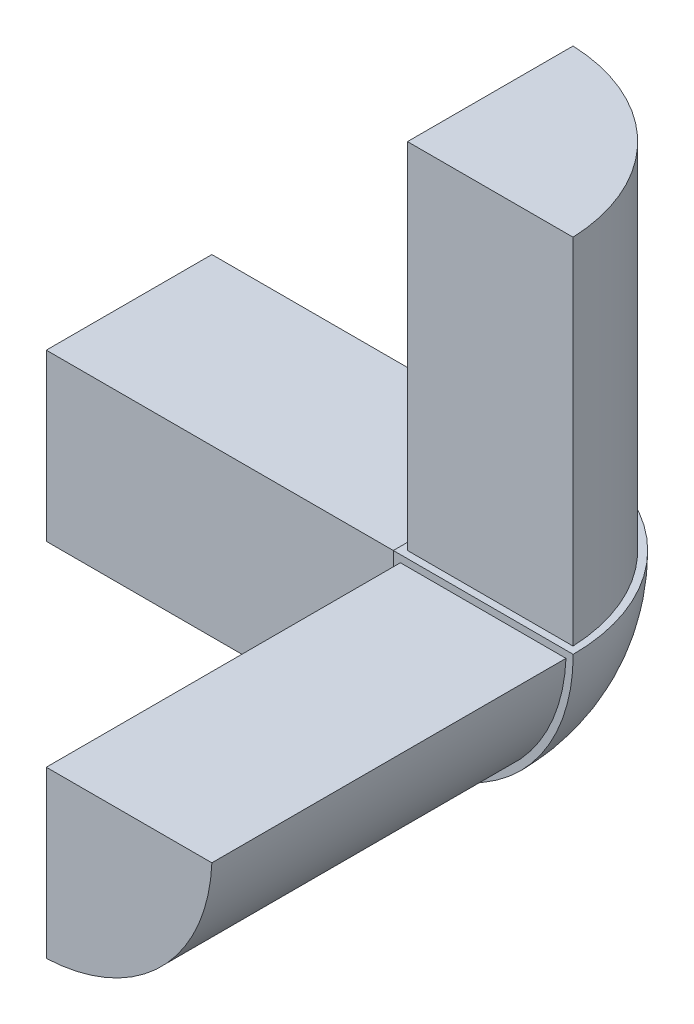
ISO-10303-21;
HEADER;
FILE_DESCRIPTION(('STEP AP214'),'2;1');
FILE_NAME('part.step','',(''),(''),'','','');
FILE_SCHEMA(('AUTOMOTIVE_DESIGN { 1 0 10303 214 1 1 1 1 }'));
ENDSEC;
DATA;
#1=APPLICATION_CONTEXT('core data for automotive mechanical design processes');
#2=APPLICATION_PROTOCOL_DEFINITION('international standard','automotive_design',2000,#1);
#3=PRODUCT_CONTEXT('',#1,'mechanical');
#4=PRODUCT('Part','Part','',(#3));
#5=PRODUCT_RELATED_PRODUCT_CATEGORY('part','',(#4));
#6=PRODUCT_DEFINITION_FORMATION('','',#4);
#7=PRODUCT_DEFINITION_CONTEXT('part definition',#1,'design');
#8=PRODUCT_DEFINITION('design','',#6,#7);
#9=PRODUCT_DEFINITION_SHAPE('','',#8);
#10=(LENGTH_UNIT() NAMED_UNIT(*) SI_UNIT(.MILLI.,.METRE.));
#11=(NAMED_UNIT(*) PLANE_ANGLE_UNIT() SI_UNIT($,.RADIAN.));
#12=(NAMED_UNIT(*) SI_UNIT($,.STERADIAN.) SOLID_ANGLE_UNIT());
#13=UNCERTAINTY_MEASURE_WITH_UNIT(LENGTH_MEASURE(1.E-05),#10,'distance_accuracy_value','');
#14=(GEOMETRIC_REPRESENTATION_CONTEXT(3) GLOBAL_UNCERTAINTY_ASSIGNED_CONTEXT((#13)) GLOBAL_UNIT_ASSIGNED_CONTEXT((#10,
#11,#12)) REPRESENTATION_CONTEXT('',''));
#15=CARTESIAN_POINT('',(0.,0.,0.));
#16=DIRECTION('',(0.,0.,1.));
#17=DIRECTION('',(1.,0.,0.));
#18=AXIS2_PLACEMENT_3D('',#15,#16,#17);
#19=CARTESIAN_POINT('',(0.,0.,50.));
#20=DIRECTION('',(1.,0.,0.));
#21=DIRECTION('',(0.,1.,0.));
#22=AXIS2_PLACEMENT_3D('',#19,#20,#21);
#23=PLANE('',#22);
#24=DIRECTION('',(0.,0.,-1.));
#25=VECTOR('',#24,1.);
#26=CARTESIAN_POINT('',(0.,-1.,-1.));
#27=LINE('',#26,#25);
#28=CARTESIAN_POINT('',(0.,-1.,-1.));
#29=VERTEX_POINT('',#28);
#30=CARTESIAN_POINT('',(0.,-1.,-24.3794995846921));
#31=VERTEX_POINT('',#30);
#32=EDGE_CURVE('E184',#29,#31,#27,.T.);
#33=ORIENTED_EDGE('',*,*,#32,.F.);
#34=DIRECTION('',(0.,1.,0.));
#35=VECTOR('',#34,1.);
#36=CARTESIAN_POINT('',(0.,-24.3794995846921,-1.));
#37=LINE('',#36,#35);
#38=CARTESIAN_POINT('',(0.,-24.3794995846921,-1.));
#39=VERTEX_POINT('',#38);
#40=EDGE_CURVE('E180',#39,#29,#37,.T.);
#41=ORIENTED_EDGE('',*,*,#40,.F.);
#42=CARTESIAN_POINT('',(0.,0.,0.));
#43=DIRECTION('',(-1.,0.,0.));
#44=DIRECTION('',(0.,0.,1.));
#45=AXIS2_PLACEMENT_3D('',#42,#43,#44);
#46=CIRCLE('',#45,24.4);
#47=EDGE_CURVE('E177',#31,#39,#46,.T.);
#48=ORIENTED_EDGE('',*,*,#47,.F.);
#49=EDGE_LOOP('',(#33,#41,#48));
#50=FACE_BOUND('',#49,.T.);
#51=DIRECTION('',(0.,-1.,0.));
#52=VECTOR('',#51,1.);
#53=CARTESIAN_POINT('',(0.,0.,0.));
#54=LINE('',#53,#52);
#55=CARTESIAN_POINT('',(0.,0.,0.));
#56=VERTEX_POINT('',#55);
#57=CARTESIAN_POINT('',(0.,-25.4,0.));
#58=VERTEX_POINT('',#57);
#59=EDGE_CURVE('E152',#56,#58,#54,.T.);
#60=ORIENTED_EDGE('',*,*,#59,.F.);
#61=DIRECTION('',(0.,0.,-1.));
#62=VECTOR('',#61,1.);
#63=CARTESIAN_POINT('',(0.,0.,50.));
#64=LINE('',#63,#62);
#65=CARTESIAN_POINT('',(0.,0.,-25.4));
#66=VERTEX_POINT('',#65);
#67=EDGE_CURVE('E42',#56,#66,#64,.T.);
#68=ORIENTED_EDGE('',*,*,#67,.T.);
#69=CARTESIAN_POINT('',(0.,0.,0.));
#70=DIRECTION('',(1.,0.,0.));
#71=DIRECTION('',(0.,0.,-1.));
#72=AXIS2_PLACEMENT_3D('',#69,#70,#71);
#73=CIRCLE('',#72,25.4);
#74=EDGE_CURVE('E197',#58,#66,#73,.T.);
#75=ORIENTED_EDGE('',*,*,#74,.F.);
#76=EDGE_LOOP('',(#60,#68,#75));
#77=FACE_BOUND('',#76,.T.);
#78=ADVANCED_FACE('F34',(#50,#77),#23,.F.);
#79=CARTESIAN_POINT('',(0.,0.,50.));
#80=DIRECTION('',(0.,-1.,0.));
#81=DIRECTION('',(0.,0.,-1.));
#82=AXIS2_PLACEMENT_3D('',#79,#80,#81);
#83=PLANE('',#82);
#84=DIRECTION('',(1.,0.,0.));
#85=VECTOR('',#84,1.);
#86=CARTESIAN_POINT('',(1.00000000000001,0.,-0.999999999999962));
#87=LINE('',#86,#85);
#88=CARTESIAN_POINT('',(1.00000000000001,0.,-0.999999999999962));
#89=VERTEX_POINT('',#88);
#90=CARTESIAN_POINT('',(24.3794995846921,0.,-0.999999999999962));
#91=VERTEX_POINT('',#90);
#92=EDGE_CURVE('E161',#89,#91,#87,.T.);
#93=ORIENTED_EDGE('',*,*,#92,.F.);
#94=DIRECTION('',(0.,0.,1.));
#95=VECTOR('',#94,1.);
#96=CARTESIAN_POINT('',(1.00000000000001,0.,-24.3794995846921));
#97=LINE('',#96,#95);
#98=CARTESIAN_POINT('',(1.00000000000001,0.,-24.3794995846921));
#99=VERTEX_POINT('',#98);
#100=EDGE_CURVE('E158',#99,#89,#97,.T.);
#101=ORIENTED_EDGE('',*,*,#100,.F.);
#102=CARTESIAN_POINT('',(0.,0.,0.));
#103=DIRECTION('',(0.,1.,0.));
#104=DIRECTION('',(0.,0.,1.));
#105=AXIS2_PLACEMENT_3D('',#102,#103,#104);
#106=CIRCLE('',#105,24.4);
#107=EDGE_CURVE('E155',#91,#99,#106,.T.);
#108=ORIENTED_EDGE('',*,*,#107,.F.);
#109=EDGE_LOOP('',(#93,#101,#108));
#110=FACE_BOUND('',#109,.T.);
#111=DIRECTION('',(-1.,0.,0.));
#112=VECTOR('',#111,1.);
#113=CARTESIAN_POINT('',(25.4,0.,0.));
#114=LINE('',#113,#112);
#115=CARTESIAN_POINT('',(25.4,0.,0.));
#116=VERTEX_POINT('',#115);
#117=EDGE_CURVE('E149',#116,#56,#114,.T.);
#118=ORIENTED_EDGE('',*,*,#117,.F.);
#119=CARTESIAN_POINT('',(0.,0.,0.));
#120=DIRECTION('',(0.,1.,0.));
#121=DIRECTION('',(0.,0.,-1.));
#122=AXIS2_PLACEMENT_3D('',#119,#120,#121);
#123=CIRCLE('',#122,25.4);
#124=EDGE_CURVE('E11',#116,#66,#123,.T.);
#125=ORIENTED_EDGE('',*,*,#124,.T.);
#126=ORIENTED_EDGE('',*,*,#67,.F.);
#127=EDGE_LOOP('',(#118,#125,#126));
#128=FACE_BOUND('',#127,.T.);
#129=ADVANCED_FACE('F213',(#110,#128),#83,.F.);
#130=CARTESIAN_POINT('',(0.,0.,0.));
#131=DIRECTION('',(0.,1.,0.));
#132=DIRECTION('',(-1.,0.,0.));
#133=AXIS2_PLACEMENT_3D('',#130,#131,#132);
#134=SPHERICAL_SURFACE('',#133,25.4);
#135=CARTESIAN_POINT('',(0.,0.,0.));
#136=DIRECTION('',(0.,0.,1.));
#137=DIRECTION('',(1.,0.,0.));
#138=AXIS2_PLACEMENT_3D('',#135,#136,#137);
#139=CIRCLE('',#138,25.4);
#140=EDGE_CURVE('E204',#58,#116,#139,.T.);
#141=ORIENTED_EDGE('',*,*,#140,.F.);
#142=ORIENTED_EDGE('',*,*,#74,.T.);
#143=ORIENTED_EDGE('',*,*,#124,.F.);
#144=EDGE_LOOP('',(#141,#142,#143));
#145=FACE_BOUND('',#144,.T.);
#146=ADVANCED_FACE('F36',(#145),#134,.T.);
#147=CARTESIAN_POINT('',(0.,0.,0.));
#148=DIRECTION('',(-1.,0.,0.));
#149=DIRECTION('',(0.,0.,1.));
#150=AXIS2_PLACEMENT_3D('',#147,#148,#149);
#151=CYLINDRICAL_SURFACE('',#150,24.4);
#152=CARTESIAN_POINT('',(-50.,0.,0.));
#153=DIRECTION('',(-1.,0.,0.));
#154=DIRECTION('',(0.,0.,1.));
#155=AXIS2_PLACEMENT_3D('',#152,#153,#154);
#156=CIRCLE('',#155,24.4);
#157=CARTESIAN_POINT('',(-50.,-1.,-24.3794995846921));
#158=VERTEX_POINT('',#157);
#159=CARTESIAN_POINT('',(-50.,-24.3794995846921,-1.));
#160=VERTEX_POINT('',#159);
#161=EDGE_CURVE('E173',#158,#160,#156,.T.);
#162=ORIENTED_EDGE('',*,*,#161,.F.);
#163=DIRECTION('',(-1.,0.,0.));
#164=VECTOR('',#163,1.);
#165=CARTESIAN_POINT('',(0.,-1.,-24.3794995846921));
#166=LINE('',#165,#164);
#167=EDGE_CURVE('E195',#31,#158,#166,.T.);
#168=ORIENTED_EDGE('',*,*,#167,.F.);
#169=ORIENTED_EDGE('',*,*,#47,.T.);
#170=DIRECTION('',(-1.,0.,0.));
#171=VECTOR('',#170,1.);
#172=CARTESIAN_POINT('',(0.,-24.3794995846921,-1.));
#173=LINE('',#172,#171);
#174=EDGE_CURVE('E187',#39,#160,#173,.T.);
#175=ORIENTED_EDGE('',*,*,#174,.T.);
#176=EDGE_LOOP('',(#162,#168,#169,#175));
#177=FACE_BOUND('',#176,.T.);
#178=ADVANCED_FACE('F246',(#177),#151,.T.);
#179=CARTESIAN_POINT('',(0.,-1.,-1.));
#180=DIRECTION('',(0.,1.,0.));
#181=DIRECTION('',(0.,0.,1.));
#182=AXIS2_PLACEMENT_3D('',#179,#180,#181);
#183=PLANE('',#182);
#184=DIRECTION('',(0.,0.,-1.));
#185=VECTOR('',#184,1.);
#186=CARTESIAN_POINT('',(-50.,-1.,-1.));
#187=LINE('',#186,#185);
#188=CARTESIAN_POINT('',(-50.,-1.,-1.));
#189=VERTEX_POINT('',#188);
#190=EDGE_CURVE('E181',#189,#158,#187,.T.);
#191=ORIENTED_EDGE('',*,*,#190,.F.);
#192=DIRECTION('',(-1.,0.,0.));
#193=VECTOR('',#192,1.);
#194=CARTESIAN_POINT('',(0.,-1.,-1.));
#195=LINE('',#194,#193);
#196=EDGE_CURVE('E198',#29,#189,#195,.T.);
#197=ORIENTED_EDGE('',*,*,#196,.F.);
#198=ORIENTED_EDGE('',*,*,#32,.T.);
#199=ORIENTED_EDGE('',*,*,#167,.T.);
#200=EDGE_LOOP('',(#191,#197,#198,#199));
#201=FACE_BOUND('',#200,.T.);
#202=ADVANCED_FACE('F249',(#201),#183,.T.);
#203=CARTESIAN_POINT('',(0.,-24.3794995846921,-1.));
#204=DIRECTION('',(0.,0.,1.));
#205=DIRECTION('',(1.,0.,0.));
#206=AXIS2_PLACEMENT_3D('',#203,#204,#205);
#207=PLANE('',#206);
#208=DIRECTION('',(0.,1.,0.));
#209=VECTOR('',#208,1.);
#210=CARTESIAN_POINT('',(-50.,-24.3794995846921,-1.));
#211=LINE('',#210,#209);
#212=EDGE_CURVE('E190',#160,#189,#211,.T.);
#213=ORIENTED_EDGE('',*,*,#212,.F.);
#214=ORIENTED_EDGE('',*,*,#174,.F.);
#215=ORIENTED_EDGE('',*,*,#40,.T.);
#216=ORIENTED_EDGE('',*,*,#196,.T.);
#217=EDGE_LOOP('',(#213,#214,#215,#216));
#218=FACE_BOUND('',#217,.T.);
#219=ADVANCED_FACE('F244',(#218),#207,.T.);
#220=CARTESIAN_POINT('',(-50.,0.,0.));
#221=DIRECTION('',(1.,0.,0.));
#222=DIRECTION('',(0.,0.,-1.));
#223=AXIS2_PLACEMENT_3D('',#220,#221,#222);
#224=PLANE('',#223);
#225=ORIENTED_EDGE('',*,*,#161,.T.);
#226=ORIENTED_EDGE('',*,*,#212,.T.);
#227=ORIENTED_EDGE('',*,*,#190,.T.);
#228=EDGE_LOOP('',(#225,#226,#227));
#229=FACE_BOUND('',#228,.T.);
#230=ADVANCED_FACE('F240',(#229),#224,.F.);
#231=CARTESIAN_POINT('',(0.,0.,0.));
#232=DIRECTION('',(0.,1.,0.));
#233=DIRECTION('',(0.,0.,1.));
#234=AXIS2_PLACEMENT_3D('',#231,#232,#233);
#235=CYLINDRICAL_SURFACE('',#234,24.4);
#236=CARTESIAN_POINT('',(0.,50.,0.));
#237=DIRECTION('',(0.,1.,0.));
#238=DIRECTION('',(0.,0.,1.));
#239=AXIS2_PLACEMENT_3D('',#236,#237,#238);
#240=CIRCLE('',#239,24.4);
#241=CARTESIAN_POINT('',(24.3794995846921,50.,-0.999999999999962));
#242=VERTEX_POINT('',#241);
#243=CARTESIAN_POINT('',(1.00000000000001,50.,-24.3794995846921));
#244=VERTEX_POINT('',#243);
#245=EDGE_CURVE('E154',#242,#244,#240,.T.);
#246=ORIENTED_EDGE('',*,*,#245,.F.);
#247=DIRECTION('',(0.,1.,0.));
#248=VECTOR('',#247,1.);
#249=CARTESIAN_POINT('',(24.3794995846921,0.,-0.999999999999962));
#250=LINE('',#249,#248);
#251=EDGE_CURVE('E171',#91,#242,#250,.T.);
#252=ORIENTED_EDGE('',*,*,#251,.F.);
#253=ORIENTED_EDGE('',*,*,#107,.T.);
#254=DIRECTION('',(0.,1.,0.));
#255=VECTOR('',#254,1.);
#256=CARTESIAN_POINT('',(1.00000000000001,0.,-24.3794995846921));
#257=LINE('',#256,#255);
#258=EDGE_CURVE('E164',#99,#244,#257,.T.);
#259=ORIENTED_EDGE('',*,*,#258,.T.);
#260=EDGE_LOOP('',(#246,#252,#253,#259));
#261=FACE_BOUND('',#260,.T.);
#262=ADVANCED_FACE('F243',(#261),#235,.T.);
#263=CARTESIAN_POINT('',(1.00000000000001,0.,-0.999999999999962));
#264=DIRECTION('',(0.,0.,1.));
#265=DIRECTION('',(1.,0.,0.));
#266=AXIS2_PLACEMENT_3D('',#263,#264,#265);
#267=PLANE('',#266);
#268=DIRECTION('',(1.,0.,0.));
#269=VECTOR('',#268,1.);
#270=CARTESIAN_POINT('',(1.00000000000001,50.,-0.999999999999962));
#271=LINE('',#270,#269);
#272=CARTESIAN_POINT('',(1.00000000000001,50.,-0.999999999999962));
#273=VERTEX_POINT('',#272);
#274=EDGE_CURVE('E57',#273,#242,#271,.T.);
#275=ORIENTED_EDGE('',*,*,#274,.F.);
#276=DIRECTION('',(0.,1.,0.));
#277=VECTOR('',#276,1.);
#278=CARTESIAN_POINT('',(1.00000000000001,0.,-0.999999999999962));
#279=LINE('',#278,#277);
#280=EDGE_CURVE('E174',#89,#273,#279,.T.);
#281=ORIENTED_EDGE('',*,*,#280,.F.);
#282=ORIENTED_EDGE('',*,*,#92,.T.);
#283=ORIENTED_EDGE('',*,*,#251,.T.);
#284=EDGE_LOOP('',(#275,#281,#282,#283));
#285=FACE_BOUND('',#284,.T.);
#286=ADVANCED_FACE('F259',(#285),#267,.T.);
#287=CARTESIAN_POINT('',(1.00000000000001,0.,-24.3794995846921));
#288=DIRECTION('',(-1.,0.,0.));
#289=DIRECTION('',(0.,0.,1.));
#290=AXIS2_PLACEMENT_3D('',#287,#288,#289);
#291=PLANE('',#290);
#292=DIRECTION('',(0.,0.,1.));
#293=VECTOR('',#292,1.);
#294=CARTESIAN_POINT('',(1.00000000000001,50.,-24.3794995846921));
#295=LINE('',#294,#293);
#296=EDGE_CURVE('E167',#244,#273,#295,.T.);
#297=ORIENTED_EDGE('',*,*,#296,.F.);
#298=ORIENTED_EDGE('',*,*,#258,.F.);
#299=ORIENTED_EDGE('',*,*,#100,.T.);
#300=ORIENTED_EDGE('',*,*,#280,.T.);
#301=EDGE_LOOP('',(#297,#298,#299,#300));
#302=FACE_BOUND('',#301,.T.);
#303=ADVANCED_FACE('F224',(#302),#291,.T.);
#304=CARTESIAN_POINT('',(0.,50.,0.));
#305=DIRECTION('',(0.,-1.,0.));
#306=DIRECTION('',(0.,0.,-1.));
#307=AXIS2_PLACEMENT_3D('',#304,#305,#306);
#308=PLANE('',#307);
#309=ORIENTED_EDGE('',*,*,#245,.T.);
#310=ORIENTED_EDGE('',*,*,#296,.T.);
#311=ORIENTED_EDGE('',*,*,#274,.T.);
#312=EDGE_LOOP('',(#309,#310,#311));
#313=FACE_BOUND('',#312,.T.);
#314=ADVANCED_FACE('F216',(#313),#308,.F.);
#315=CARTESIAN_POINT('',(0.,0.,0.));
#316=DIRECTION('',(0.,0.,1.));
#317=DIRECTION('',(1.,0.,0.));
#318=AXIS2_PLACEMENT_3D('',#315,#316,#317);
#319=PLANE('',#318);
#320=CARTESIAN_POINT('',(0.,0.,0.));
#321=DIRECTION('',(0.,0.,1.));
#322=DIRECTION('',(1.,0.,0.));
#323=AXIS2_PLACEMENT_3D('',#320,#321,#322);
#324=CIRCLE('',#323,24.4);
#325=CARTESIAN_POINT('',(1.00000000000027,-24.379499584692,0.));
#326=VERTEX_POINT('',#325);
#327=CARTESIAN_POINT('',(24.3794995846921,-0.999999999999997,0.));
#328=VERTEX_POINT('',#327);
#329=EDGE_CURVE('E130',#326,#328,#324,.T.);
#330=ORIENTED_EDGE('',*,*,#329,.F.);
#331=DIRECTION('',(0.,-1.,0.));
#332=VECTOR('',#331,1.);
#333=CARTESIAN_POINT('',(1.00000000000001,-1.,0.));
#334=LINE('',#333,#332);
#335=CARTESIAN_POINT('',(1.00000000000001,-1.,0.));
#336=VERTEX_POINT('',#335);
#337=EDGE_CURVE('E122',#336,#326,#334,.T.);
#338=ORIENTED_EDGE('',*,*,#337,.F.);
#339=DIRECTION('',(-1.,0.,0.));
#340=VECTOR('',#339,1.);
#341=CARTESIAN_POINT('',(24.3794995846921,-1.,0.));
#342=LINE('',#341,#340);
#343=EDGE_CURVE('E136',#328,#336,#342,.T.);
#344=ORIENTED_EDGE('',*,*,#343,.F.);
#345=EDGE_LOOP('',(#330,#338,#344));
#346=FACE_BOUND('',#345,.T.);
#347=ORIENTED_EDGE('',*,*,#117,.T.);
#348=ORIENTED_EDGE('',*,*,#59,.T.);
#349=ORIENTED_EDGE('',*,*,#140,.T.);
#350=EDGE_LOOP('',(#347,#348,#349));
#351=FACE_BOUND('',#350,.T.);
#352=ADVANCED_FACE('F134',(#346,#351),#319,.T.);
#353=CARTESIAN_POINT('',(24.3794995846921,-1.,0.));
#354=DIRECTION('',(0.,1.,0.));
#355=DIRECTION('',(0.,0.,1.));
#356=AXIS2_PLACEMENT_3D('',#353,#354,#355);
#357=PLANE('',#356);
#358=DIRECTION('',(-1.,0.,0.));
#359=VECTOR('',#358,1.);
#360=CARTESIAN_POINT('',(24.3794995846921,-1.,50.));
#361=LINE('',#360,#359);
#362=CARTESIAN_POINT('',(24.3794995846921,-0.999999999999997,50.));
#363=VERTEX_POINT('',#362);
#364=CARTESIAN_POINT('',(1.00000000000001,-1.,50.));
#365=VERTEX_POINT('',#364);
#366=EDGE_CURVE('E145',#363,#365,#361,.T.);
#367=ORIENTED_EDGE('',*,*,#366,.F.);
#368=DIRECTION('',(0.,0.,1.));
#369=VECTOR('',#368,1.);
#370=CARTESIAN_POINT('',(24.3794995846921,-0.999999999999997,0.));
#371=LINE('',#370,#369);
#372=EDGE_CURVE('E140',#328,#363,#371,.T.);
#373=ORIENTED_EDGE('',*,*,#372,.F.);
#374=ORIENTED_EDGE('',*,*,#343,.T.);
#375=DIRECTION('',(0.,0.,1.));
#376=VECTOR('',#375,1.);
#377=CARTESIAN_POINT('',(1.00000000000001,-1.,0.));
#378=LINE('',#377,#376);
#379=EDGE_CURVE('E119',#336,#365,#378,.T.);
#380=ORIENTED_EDGE('',*,*,#379,.T.);
#381=EDGE_LOOP('',(#367,#373,#374,#380));
#382=FACE_BOUND('',#381,.T.);
#383=ADVANCED_FACE('F139',(#382),#357,.T.);
#384=CARTESIAN_POINT('',(0.,0.,0.));
#385=DIRECTION('',(0.,0.,1.));
#386=DIRECTION('',(1.,0.,0.));
#387=AXIS2_PLACEMENT_3D('',#384,#385,#386);
#388=CYLINDRICAL_SURFACE('',#387,24.4);
#389=CARTESIAN_POINT('',(0.,0.,50.));
#390=DIRECTION('',(0.,0.,1.));
#391=DIRECTION('',(1.,0.,0.));
#392=AXIS2_PLACEMENT_3D('',#389,#390,#391);
#393=CIRCLE('',#392,24.4);
#394=CARTESIAN_POINT('',(1.00000000000027,-24.379499584692,50.));
#395=VERTEX_POINT('',#394);
#396=EDGE_CURVE('E49',#395,#363,#393,.T.);
#397=ORIENTED_EDGE('',*,*,#396,.F.);
#398=DIRECTION('',(0.,0.,1.));
#399=VECTOR('',#398,1.);
#400=CARTESIAN_POINT('',(1.00000000000027,-24.379499584692,0.));
#401=LINE('',#400,#399);
#402=EDGE_CURVE('E129',#326,#395,#401,.T.);
#403=ORIENTED_EDGE('',*,*,#402,.F.);
#404=ORIENTED_EDGE('',*,*,#329,.T.);
#405=ORIENTED_EDGE('',*,*,#372,.T.);
#406=EDGE_LOOP('',(#397,#403,#404,#405));
#407=FACE_BOUND('',#406,.T.);
#408=ADVANCED_FACE('F222',(#407),#388,.T.);
#409=CARTESIAN_POINT('',(1.00000000000001,-1.,0.));
#410=DIRECTION('',(-1.,0.,0.));
#411=DIRECTION('',(0.,-1.,0.));
#412=AXIS2_PLACEMENT_3D('',#409,#410,#411);
#413=PLANE('',#412);
#414=DIRECTION('',(0.,-1.,0.));
#415=VECTOR('',#414,1.);
#416=CARTESIAN_POINT('',(1.00000000000001,-1.,50.));
#417=LINE('',#416,#415);
#418=EDGE_CURVE('E124',#365,#395,#417,.T.);
#419=ORIENTED_EDGE('',*,*,#418,.F.);
#420=ORIENTED_EDGE('',*,*,#379,.F.);
#421=ORIENTED_EDGE('',*,*,#337,.T.);
#422=ORIENTED_EDGE('',*,*,#402,.T.);
#423=EDGE_LOOP('',(#419,#420,#421,#422));
#424=FACE_BOUND('',#423,.T.);
#425=ADVANCED_FACE('F121',(#424),#413,.T.);
#426=CARTESIAN_POINT('',(0.,0.,50.));
#427=DIRECTION('',(0.,0.,1.));
#428=DIRECTION('',(1.,0.,0.));
#429=AXIS2_PLACEMENT_3D('',#426,#427,#428);
#430=PLANE('',#429);
#431=ORIENTED_EDGE('',*,*,#396,.T.);
#432=ORIENTED_EDGE('',*,*,#366,.T.);
#433=ORIENTED_EDGE('',*,*,#418,.T.);
#434=EDGE_LOOP('',(#431,#432,#433));
#435=FACE_BOUND('',#434,.T.);
#436=ADVANCED_FACE('F236',(#435),#430,.T.);
#437=CLOSED_SHELL('',(#78,#129,#146,#178,#202,#219,#230,#262,#286,#303,#314,#352,#383,#408,#425,#436));
#438=MANIFOLD_SOLID_BREP('B2',#437);
#439=ADVANCED_BREP_SHAPE_REPRESENTATION('',(#18,#438),#14);
#440=SHAPE_DEFINITION_REPRESENTATION(#9,#439);
ENDSEC;
END-ISO-10303-21;
